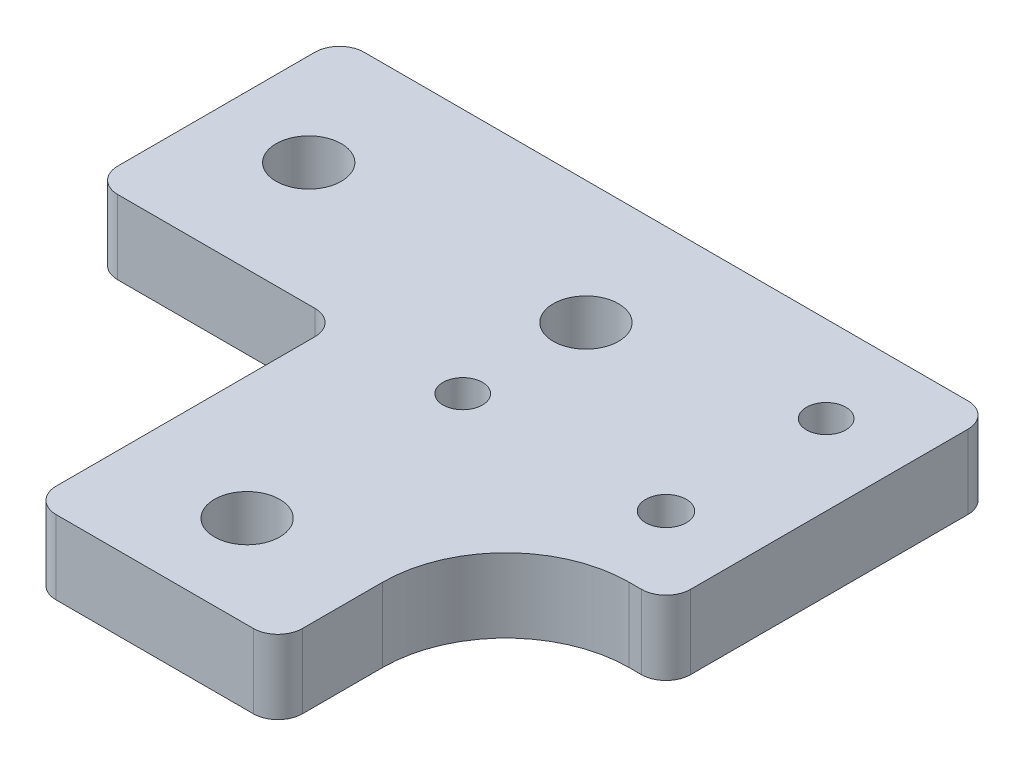
ISO-10303-21;
HEADER;
FILE_DESCRIPTION(('STEP AP214'),'2;1');
FILE_NAME('part.step','',(''),(''),'','','');
FILE_SCHEMA(('AUTOMOTIVE_DESIGN { 1 0 10303 214 1 1 1 1 }'));
ENDSEC;
DATA;
#1=APPLICATION_CONTEXT('core data for automotive mechanical design processes');
#2=APPLICATION_PROTOCOL_DEFINITION('international standard','automotive_design',2000,#1);
#3=PRODUCT_CONTEXT('',#1,'mechanical');
#4=PRODUCT('Part','Part','',(#3));
#5=PRODUCT_RELATED_PRODUCT_CATEGORY('part','',(#4));
#6=PRODUCT_DEFINITION_FORMATION('','',#4);
#7=PRODUCT_DEFINITION_CONTEXT('part definition',#1,'design');
#8=PRODUCT_DEFINITION('design','',#6,#7);
#9=PRODUCT_DEFINITION_SHAPE('','',#8);
#10=(LENGTH_UNIT() NAMED_UNIT(*) SI_UNIT(.MILLI.,.METRE.));
#11=(NAMED_UNIT(*) PLANE_ANGLE_UNIT() SI_UNIT($,.RADIAN.));
#12=(NAMED_UNIT(*) SI_UNIT($,.STERADIAN.) SOLID_ANGLE_UNIT());
#13=UNCERTAINTY_MEASURE_WITH_UNIT(LENGTH_MEASURE(1.E-05),#10,'distance_accuracy_value','');
#14=(GEOMETRIC_REPRESENTATION_CONTEXT(3) GLOBAL_UNCERTAINTY_ASSIGNED_CONTEXT((#13)) GLOBAL_UNIT_ASSIGNED_CONTEXT((#10,
#11,#12)) REPRESENTATION_CONTEXT('',''));
#15=CARTESIAN_POINT('',(0.,0.,0.));
#16=DIRECTION('',(0.,0.,1.));
#17=DIRECTION('',(1.,0.,0.));
#18=AXIS2_PLACEMENT_3D('',#15,#16,#17);
#19=CARTESIAN_POINT('',(104.,0.,2.));
#20=DIRECTION('',(0.,1.,0.));
#21=DIRECTION('',(0.,0.,1.));
#22=AXIS2_PLACEMENT_3D('',#19,#20,#21);
#23=CYLINDRICAL_SURFACE('',#22,2.);
#24=CARTESIAN_POINT('',(104.,6.,2.));
#25=DIRECTION('',(0.,1.,0.));
#26=DIRECTION('',(0.,0.,1.));
#27=AXIS2_PLACEMENT_3D('',#24,#25,#26);
#28=CIRCLE('',#27,2.);
#29=CARTESIAN_POINT('',(106.,6.,2.));
#30=VERTEX_POINT('',#29);
#31=CARTESIAN_POINT('',(104.,6.,0.));
#32=VERTEX_POINT('',#31);
#33=EDGE_CURVE('E184',#30,#32,#28,.T.);
#34=ORIENTED_EDGE('',*,*,#33,.F.);
#35=DIRECTION('',(0.,1.,0.));
#36=VECTOR('',#35,1.);
#37=CARTESIAN_POINT('',(106.,0.,2.));
#38=LINE('',#37,#36);
#39=CARTESIAN_POINT('',(106.,0.,2.));
#40=VERTEX_POINT('',#39);
#41=EDGE_CURVE('E11',#40,#30,#38,.T.);
#42=ORIENTED_EDGE('',*,*,#41,.F.);
#43=CARTESIAN_POINT('',(104.,0.,2.));
#44=DIRECTION('',(0.,1.,0.));
#45=DIRECTION('',(0.,0.,1.));
#46=AXIS2_PLACEMENT_3D('',#43,#44,#45);
#47=CIRCLE('',#46,2.);
#48=CARTESIAN_POINT('',(104.,0.,0.));
#49=VERTEX_POINT('',#48);
#50=EDGE_CURVE('E229',#40,#49,#47,.T.);
#51=ORIENTED_EDGE('',*,*,#50,.T.);
#52=DIRECTION('',(0.,1.,0.));
#53=VECTOR('',#52,1.);
#54=CARTESIAN_POINT('',(104.,0.,0.));
#55=LINE('',#54,#53);
#56=EDGE_CURVE('E42',#49,#32,#55,.T.);
#57=ORIENTED_EDGE('',*,*,#56,.T.);
#58=EDGE_LOOP('',(#34,#42,#51,#57));
#59=FACE_BOUND('',#58,.T.);
#60=ADVANCED_FACE('F39',(#59),#23,.T.);
#61=CARTESIAN_POINT('',(106.,0.,24.5));
#62=DIRECTION('',(1.,0.,0.));
#63=DIRECTION('',(0.,0.,-1.));
#64=AXIS2_PLACEMENT_3D('',#61,#62,#63);
#65=PLANE('',#64);
#66=DIRECTION('',(0.,0.,-1.));
#67=VECTOR('',#66,1.);
#68=CARTESIAN_POINT('',(106.,6.,24.5));
#69=LINE('',#68,#67);
#70=CARTESIAN_POINT('',(106.,6.,24.5));
#71=VERTEX_POINT('',#70);
#72=EDGE_CURVE('E227',#71,#30,#69,.T.);
#73=ORIENTED_EDGE('',*,*,#72,.F.);
#74=DIRECTION('',(0.,1.,0.));
#75=VECTOR('',#74,1.);
#76=CARTESIAN_POINT('',(106.,0.,24.5));
#77=LINE('',#76,#75);
#78=CARTESIAN_POINT('',(106.,0.,24.5));
#79=VERTEX_POINT('',#78);
#80=EDGE_CURVE('E48',#79,#71,#77,.T.);
#81=ORIENTED_EDGE('',*,*,#80,.F.);
#82=DIRECTION('',(0.,0.,-1.));
#83=VECTOR('',#82,1.);
#84=CARTESIAN_POINT('',(106.,0.,24.5));
#85=LINE('',#84,#83);
#86=EDGE_CURVE('E174',#79,#40,#85,.T.);
#87=ORIENTED_EDGE('',*,*,#86,.T.);
#88=ORIENTED_EDGE('',*,*,#41,.T.);
#89=EDGE_LOOP('',(#73,#81,#87,#88));
#90=FACE_BOUND('',#89,.T.);
#91=ADVANCED_FACE('F257',(#90),#65,.T.);
#92=CARTESIAN_POINT('',(104.,0.,24.5));
#93=DIRECTION('',(0.,1.,0.));
#94=DIRECTION('',(0.,0.,1.));
#95=AXIS2_PLACEMENT_3D('',#92,#93,#94);
#96=CYLINDRICAL_SURFACE('',#95,2.);
#97=CARTESIAN_POINT('',(104.,6.,24.5));
#98=DIRECTION('',(0.,1.,0.));
#99=DIRECTION('',(0.,0.,1.));
#100=AXIS2_PLACEMENT_3D('',#97,#98,#99);
#101=CIRCLE('',#100,2.);
#102=CARTESIAN_POINT('',(104.,6.,26.5));
#103=VERTEX_POINT('',#102);
#104=EDGE_CURVE('E161',#103,#71,#101,.T.);
#105=ORIENTED_EDGE('',*,*,#104,.F.);
#106=DIRECTION('',(0.,1.,0.));
#107=VECTOR('',#106,1.);
#108=CARTESIAN_POINT('',(104.,0.,26.5));
#109=LINE('',#108,#107);
#110=CARTESIAN_POINT('',(104.,0.,26.5));
#111=VERTEX_POINT('',#110);
#112=EDGE_CURVE('E156',#111,#103,#109,.T.);
#113=ORIENTED_EDGE('',*,*,#112,.F.);
#114=CARTESIAN_POINT('',(104.,0.,24.5));
#115=DIRECTION('',(0.,1.,0.));
#116=DIRECTION('',(0.,0.,1.));
#117=AXIS2_PLACEMENT_3D('',#114,#115,#116);
#118=CIRCLE('',#117,2.);
#119=EDGE_CURVE('E159',#111,#79,#118,.T.);
#120=ORIENTED_EDGE('',*,*,#119,.T.);
#121=ORIENTED_EDGE('',*,*,#80,.T.);
#122=EDGE_LOOP('',(#105,#113,#120,#121));
#123=FACE_BOUND('',#122,.T.);
#124=ADVANCED_FACE('F158',(#123),#96,.T.);
#125=CARTESIAN_POINT('',(103.,0.,26.5));
#126=DIRECTION('',(0.,0.,1.));
#127=DIRECTION('',(1.,0.,0.));
#128=AXIS2_PLACEMENT_3D('',#125,#126,#127);
#129=PLANE('',#128);
#130=DIRECTION('',(1.,0.,0.));
#131=VECTOR('',#130,1.);
#132=CARTESIAN_POINT('',(103.,6.,26.5));
#133=LINE('',#132,#131);
#134=CARTESIAN_POINT('',(103.,6.,26.5));
#135=VERTEX_POINT('',#134);
#136=EDGE_CURVE('E224',#135,#103,#133,.T.);
#137=ORIENTED_EDGE('',*,*,#136,.F.);
#138=DIRECTION('',(0.,1.,0.));
#139=VECTOR('',#138,1.);
#140=CARTESIAN_POINT('',(103.,0.,26.5));
#141=LINE('',#140,#139);
#142=CARTESIAN_POINT('',(103.,0.,26.5));
#143=VERTEX_POINT('',#142);
#144=EDGE_CURVE('E166',#143,#135,#141,.T.);
#145=ORIENTED_EDGE('',*,*,#144,.F.);
#146=DIRECTION('',(1.,0.,0.));
#147=VECTOR('',#146,1.);
#148=CARTESIAN_POINT('',(103.,0.,26.5));
#149=LINE('',#148,#147);
#150=EDGE_CURVE('E172',#143,#111,#149,.T.);
#151=ORIENTED_EDGE('',*,*,#150,.T.);
#152=ORIENTED_EDGE('',*,*,#112,.T.);
#153=EDGE_LOOP('',(#137,#145,#151,#152));
#154=FACE_BOUND('',#153,.T.);
#155=ADVANCED_FACE('F176',(#154),#129,.T.);
#156=CARTESIAN_POINT('',(103.,0.,36.5));
#157=DIRECTION('',(0.,1.,0.));
#158=DIRECTION('',(0.,0.,1.));
#159=AXIS2_PLACEMENT_3D('',#156,#157,#158);
#160=CYLINDRICAL_SURFACE('',#159,10.);
#161=CARTESIAN_POINT('',(103.,6.,36.5));
#162=DIRECTION('',(0.,-1.,0.));
#163=DIRECTION('',(0.,0.,-1.));
#164=AXIS2_PLACEMENT_3D('',#161,#162,#163);
#165=CIRCLE('',#164,10.);
#166=CARTESIAN_POINT('',(93.,6.,36.5));
#167=VERTEX_POINT('',#166);
#168=EDGE_CURVE('E221',#167,#135,#165,.T.);
#169=ORIENTED_EDGE('',*,*,#168,.F.);
#170=DIRECTION('',(0.,1.,0.));
#171=VECTOR('',#170,1.);
#172=CARTESIAN_POINT('',(93.,0.,36.5));
#173=LINE('',#172,#171);
#174=CARTESIAN_POINT('',(93.,0.,36.5));
#175=VERTEX_POINT('',#174);
#176=EDGE_CURVE('E233',#175,#167,#173,.T.);
#177=ORIENTED_EDGE('',*,*,#176,.F.);
#178=CARTESIAN_POINT('',(103.,0.,36.5));
#179=DIRECTION('',(0.,-1.,0.));
#180=DIRECTION('',(0.,0.,-1.));
#181=AXIS2_PLACEMENT_3D('',#178,#179,#180);
#182=CIRCLE('',#181,10.);
#183=EDGE_CURVE('E177',#175,#143,#182,.T.);
#184=ORIENTED_EDGE('',*,*,#183,.T.);
#185=ORIENTED_EDGE('',*,*,#144,.T.);
#186=EDGE_LOOP('',(#169,#177,#184,#185));
#187=FACE_BOUND('',#186,.T.);
#188=ADVANCED_FACE('F270',(#187),#160,.F.);
#189=CARTESIAN_POINT('',(93.,0.,43.));
#190=DIRECTION('',(1.,0.,0.));
#191=DIRECTION('',(0.,0.,-1.));
#192=AXIS2_PLACEMENT_3D('',#189,#190,#191);
#193=PLANE('',#192);
#194=DIRECTION('',(0.,0.,-1.));
#195=VECTOR('',#194,1.);
#196=CARTESIAN_POINT('',(93.,6.,43.));
#197=LINE('',#196,#195);
#198=CARTESIAN_POINT('',(93.,6.,43.));
#199=VERTEX_POINT('',#198);
#200=EDGE_CURVE('E218',#199,#167,#197,.T.);
#201=ORIENTED_EDGE('',*,*,#200,.F.);
#202=DIRECTION('',(0.,1.,0.));
#203=VECTOR('',#202,1.);
#204=CARTESIAN_POINT('',(93.,0.,43.));
#205=LINE('',#204,#203);
#206=CARTESIAN_POINT('',(93.,0.,43.));
#207=VERTEX_POINT('',#206);
#208=EDGE_CURVE('E235',#207,#199,#205,.T.);
#209=ORIENTED_EDGE('',*,*,#208,.F.);
#210=DIRECTION('',(0.,0.,-1.));
#211=VECTOR('',#210,1.);
#212=CARTESIAN_POINT('',(93.,0.,43.));
#213=LINE('',#212,#211);
#214=EDGE_CURVE('E179',#207,#175,#213,.T.);
#215=ORIENTED_EDGE('',*,*,#214,.T.);
#216=ORIENTED_EDGE('',*,*,#176,.T.);
#217=EDGE_LOOP('',(#201,#209,#215,#216));
#218=FACE_BOUND('',#217,.T.);
#219=ADVANCED_FACE('F273',(#218),#193,.T.);
#220=CARTESIAN_POINT('',(91.,0.,43.));
#221=DIRECTION('',(0.,1.,0.));
#222=DIRECTION('',(0.,0.,1.));
#223=AXIS2_PLACEMENT_3D('',#220,#221,#222);
#224=CYLINDRICAL_SURFACE('',#223,2.);
#225=CARTESIAN_POINT('',(91.,6.,43.));
#226=DIRECTION('',(0.,1.,0.));
#227=DIRECTION('',(0.,0.,1.));
#228=AXIS2_PLACEMENT_3D('',#225,#226,#227);
#229=CIRCLE('',#228,2.);
#230=CARTESIAN_POINT('',(91.,6.,45.));
#231=VERTEX_POINT('',#230);
#232=EDGE_CURVE('E215',#231,#199,#229,.T.);
#233=ORIENTED_EDGE('',*,*,#232,.F.);
#234=DIRECTION('',(0.,1.,0.));
#235=VECTOR('',#234,1.);
#236=CARTESIAN_POINT('',(91.,0.,45.));
#237=LINE('',#236,#235);
#238=CARTESIAN_POINT('',(91.,0.,45.));
#239=VERTEX_POINT('',#238);
#240=EDGE_CURVE('E237',#239,#231,#237,.T.);
#241=ORIENTED_EDGE('',*,*,#240,.F.);
#242=CARTESIAN_POINT('',(91.,0.,43.));
#243=DIRECTION('',(0.,1.,0.));
#244=DIRECTION('',(0.,0.,1.));
#245=AXIS2_PLACEMENT_3D('',#242,#243,#244);
#246=CIRCLE('',#245,2.);
#247=EDGE_CURVE('E415',#239,#207,#246,.T.);
#248=ORIENTED_EDGE('',*,*,#247,.T.);
#249=ORIENTED_EDGE('',*,*,#208,.T.);
#250=EDGE_LOOP('',(#233,#241,#248,#249));
#251=FACE_BOUND('',#250,.T.);
#252=ADVANCED_FACE('F277',(#251),#224,.T.);
#253=CARTESIAN_POINT('',(75.,0.,45.));
#254=DIRECTION('',(0.,0.,1.));
#255=DIRECTION('',(1.,0.,0.));
#256=AXIS2_PLACEMENT_3D('',#253,#254,#255);
#257=PLANE('',#256);
#258=DIRECTION('',(1.,0.,0.));
#259=VECTOR('',#258,1.);
#260=CARTESIAN_POINT('',(75.,6.,45.));
#261=LINE('',#260,#259);
#262=CARTESIAN_POINT('',(75.,6.,45.));
#263=VERTEX_POINT('',#262);
#264=EDGE_CURVE('E212',#263,#231,#261,.T.);
#265=ORIENTED_EDGE('',*,*,#264,.F.);
#266=DIRECTION('',(0.,1.,0.));
#267=VECTOR('',#266,1.);
#268=CARTESIAN_POINT('',(75.,0.,45.));
#269=LINE('',#268,#267);
#270=CARTESIAN_POINT('',(75.,0.,45.));
#271=VERTEX_POINT('',#270);
#272=EDGE_CURVE('E239',#271,#263,#269,.T.);
#273=ORIENTED_EDGE('',*,*,#272,.F.);
#274=DIRECTION('',(1.,0.,0.));
#275=VECTOR('',#274,1.);
#276=CARTESIAN_POINT('',(75.,0.,45.));
#277=LINE('',#276,#275);
#278=EDGE_CURVE('E412',#271,#239,#277,.T.);
#279=ORIENTED_EDGE('',*,*,#278,.T.);
#280=ORIENTED_EDGE('',*,*,#240,.T.);
#281=EDGE_LOOP('',(#265,#273,#279,#280));
#282=FACE_BOUND('',#281,.T.);
#283=ADVANCED_FACE('F281',(#282),#257,.T.);
#284=CARTESIAN_POINT('',(75.,0.,43.));
#285=DIRECTION('',(0.,1.,0.));
#286=DIRECTION('',(0.,0.,1.));
#287=AXIS2_PLACEMENT_3D('',#284,#285,#286);
#288=CYLINDRICAL_SURFACE('',#287,2.);
#289=CARTESIAN_POINT('',(75.,6.,43.));
#290=DIRECTION('',(0.,1.,0.));
#291=DIRECTION('',(0.,0.,1.));
#292=AXIS2_PLACEMENT_3D('',#289,#290,#291);
#293=CIRCLE('',#292,2.);
#294=CARTESIAN_POINT('',(73.,6.,43.));
#295=VERTEX_POINT('',#294);
#296=EDGE_CURVE('E209',#295,#263,#293,.T.);
#297=ORIENTED_EDGE('',*,*,#296,.F.);
#298=DIRECTION('',(0.,1.,0.));
#299=VECTOR('',#298,1.);
#300=CARTESIAN_POINT('',(73.,0.,43.));
#301=LINE('',#300,#299);
#302=CARTESIAN_POINT('',(73.,0.,43.));
#303=VERTEX_POINT('',#302);
#304=EDGE_CURVE('E241',#303,#295,#301,.T.);
#305=ORIENTED_EDGE('',*,*,#304,.F.);
#306=CARTESIAN_POINT('',(75.,0.,43.));
#307=DIRECTION('',(0.,1.,0.));
#308=DIRECTION('',(0.,0.,1.));
#309=AXIS2_PLACEMENT_3D('',#306,#307,#308);
#310=CIRCLE('',#309,2.);
#311=EDGE_CURVE('E409',#303,#271,#310,.T.);
#312=ORIENTED_EDGE('',*,*,#311,.T.);
#313=ORIENTED_EDGE('',*,*,#272,.T.);
#314=EDGE_LOOP('',(#297,#305,#312,#313));
#315=FACE_BOUND('',#314,.T.);
#316=ADVANCED_FACE('F285',(#315),#288,.T.);
#317=CARTESIAN_POINT('',(73.,0.,22.));
#318=DIRECTION('',(-1.,0.,0.));
#319=DIRECTION('',(0.,0.,1.));
#320=AXIS2_PLACEMENT_3D('',#317,#318,#319);
#321=PLANE('',#320);
#322=DIRECTION('',(0.,0.,1.));
#323=VECTOR('',#322,1.);
#324=CARTESIAN_POINT('',(73.,6.,22.));
#325=LINE('',#324,#323);
#326=CARTESIAN_POINT('',(73.,6.,22.));
#327=VERTEX_POINT('',#326);
#328=EDGE_CURVE('E206',#327,#295,#325,.T.);
#329=ORIENTED_EDGE('',*,*,#328,.F.);
#330=DIRECTION('',(0.,1.,0.));
#331=VECTOR('',#330,1.);
#332=CARTESIAN_POINT('',(73.,0.,22.));
#333=LINE('',#332,#331);
#334=CARTESIAN_POINT('',(73.,0.,22.));
#335=VERTEX_POINT('',#334);
#336=EDGE_CURVE('E243',#335,#327,#333,.T.);
#337=ORIENTED_EDGE('',*,*,#336,.F.);
#338=DIRECTION('',(0.,0.,1.));
#339=VECTOR('',#338,1.);
#340=CARTESIAN_POINT('',(73.,0.,22.));
#341=LINE('',#340,#339);
#342=EDGE_CURVE('E406',#335,#303,#341,.T.);
#343=ORIENTED_EDGE('',*,*,#342,.T.);
#344=ORIENTED_EDGE('',*,*,#304,.T.);
#345=EDGE_LOOP('',(#329,#337,#343,#344));
#346=FACE_BOUND('',#345,.T.);
#347=ADVANCED_FACE('F289',(#346),#321,.T.);
#348=CARTESIAN_POINT('',(71.,0.,22.));
#349=DIRECTION('',(0.,1.,0.));
#350=DIRECTION('',(0.,0.,1.));
#351=AXIS2_PLACEMENT_3D('',#348,#349,#350);
#352=CYLINDRICAL_SURFACE('',#351,2.);
#353=CARTESIAN_POINT('',(71.,6.,22.));
#354=DIRECTION('',(0.,-1.,0.));
#355=DIRECTION('',(0.,0.,-1.));
#356=AXIS2_PLACEMENT_3D('',#353,#354,#355);
#357=CIRCLE('',#356,2.);
#358=CARTESIAN_POINT('',(71.,6.,20.));
#359=VERTEX_POINT('',#358);
#360=EDGE_CURVE('E203',#359,#327,#357,.T.);
#361=ORIENTED_EDGE('',*,*,#360,.F.);
#362=DIRECTION('',(0.,1.,0.));
#363=VECTOR('',#362,1.);
#364=CARTESIAN_POINT('',(71.,0.,20.));
#365=LINE('',#364,#363);
#366=CARTESIAN_POINT('',(71.,0.,20.));
#367=VERTEX_POINT('',#366);
#368=EDGE_CURVE('E245',#367,#359,#365,.T.);
#369=ORIENTED_EDGE('',*,*,#368,.F.);
#370=CARTESIAN_POINT('',(71.,0.,22.));
#371=DIRECTION('',(0.,-1.,0.));
#372=DIRECTION('',(0.,0.,-1.));
#373=AXIS2_PLACEMENT_3D('',#370,#371,#372);
#374=CIRCLE('',#373,2.);
#375=EDGE_CURVE('E403',#367,#335,#374,.T.);
#376=ORIENTED_EDGE('',*,*,#375,.T.);
#377=ORIENTED_EDGE('',*,*,#336,.T.);
#378=EDGE_LOOP('',(#361,#369,#376,#377));
#379=FACE_BOUND('',#378,.T.);
#380=ADVANCED_FACE('F293',(#379),#352,.F.);
#381=CARTESIAN_POINT('',(55.,0.,20.));
#382=DIRECTION('',(0.,0.,1.));
#383=DIRECTION('',(1.,0.,0.));
#384=AXIS2_PLACEMENT_3D('',#381,#382,#383);
#385=PLANE('',#384);
#386=DIRECTION('',(1.,0.,0.));
#387=VECTOR('',#386,1.);
#388=CARTESIAN_POINT('',(55.,6.,20.));
#389=LINE('',#388,#387);
#390=CARTESIAN_POINT('',(55.,6.,20.));
#391=VERTEX_POINT('',#390);
#392=EDGE_CURVE('E200',#391,#359,#389,.T.);
#393=ORIENTED_EDGE('',*,*,#392,.F.);
#394=DIRECTION('',(0.,1.,0.));
#395=VECTOR('',#394,1.);
#396=CARTESIAN_POINT('',(55.,0.,20.));
#397=LINE('',#396,#395);
#398=CARTESIAN_POINT('',(55.,0.,20.));
#399=VERTEX_POINT('',#398);
#400=EDGE_CURVE('E247',#399,#391,#397,.T.);
#401=ORIENTED_EDGE('',*,*,#400,.F.);
#402=DIRECTION('',(1.,0.,0.));
#403=VECTOR('',#402,1.);
#404=CARTESIAN_POINT('',(55.,0.,20.));
#405=LINE('',#404,#403);
#406=EDGE_CURVE('E400',#399,#367,#405,.T.);
#407=ORIENTED_EDGE('',*,*,#406,.T.);
#408=ORIENTED_EDGE('',*,*,#368,.T.);
#409=EDGE_LOOP('',(#393,#401,#407,#408));
#410=FACE_BOUND('',#409,.T.);
#411=ADVANCED_FACE('F297',(#410),#385,.T.);
#412=CARTESIAN_POINT('',(55.,0.,18.));
#413=DIRECTION('',(0.,1.,0.));
#414=DIRECTION('',(0.,0.,1.));
#415=AXIS2_PLACEMENT_3D('',#412,#413,#414);
#416=CYLINDRICAL_SURFACE('',#415,2.);
#417=CARTESIAN_POINT('',(55.,6.,18.));
#418=DIRECTION('',(0.,1.,0.));
#419=DIRECTION('',(0.,0.,1.));
#420=AXIS2_PLACEMENT_3D('',#417,#418,#419);
#421=CIRCLE('',#420,2.);
#422=CARTESIAN_POINT('',(53.,6.,18.));
#423=VERTEX_POINT('',#422);
#424=EDGE_CURVE('E197',#423,#391,#421,.T.);
#425=ORIENTED_EDGE('',*,*,#424,.F.);
#426=DIRECTION('',(0.,1.,0.));
#427=VECTOR('',#426,1.);
#428=CARTESIAN_POINT('',(53.,0.,18.));
#429=LINE('',#428,#427);
#430=CARTESIAN_POINT('',(53.,0.,18.));
#431=VERTEX_POINT('',#430);
#432=EDGE_CURVE('E249',#431,#423,#429,.T.);
#433=ORIENTED_EDGE('',*,*,#432,.F.);
#434=CARTESIAN_POINT('',(55.,0.,18.));
#435=DIRECTION('',(0.,1.,0.));
#436=DIRECTION('',(0.,0.,1.));
#437=AXIS2_PLACEMENT_3D('',#434,#435,#436);
#438=CIRCLE('',#437,2.);
#439=EDGE_CURVE('E397',#431,#399,#438,.T.);
#440=ORIENTED_EDGE('',*,*,#439,.T.);
#441=ORIENTED_EDGE('',*,*,#400,.T.);
#442=EDGE_LOOP('',(#425,#433,#440,#441));
#443=FACE_BOUND('',#442,.T.);
#444=ADVANCED_FACE('F301',(#443),#416,.T.);
#445=CARTESIAN_POINT('',(53.,0.,2.));
#446=DIRECTION('',(-1.,0.,0.));
#447=DIRECTION('',(0.,0.,1.));
#448=AXIS2_PLACEMENT_3D('',#445,#446,#447);
#449=PLANE('',#448);
#450=DIRECTION('',(0.,0.,1.));
#451=VECTOR('',#450,1.);
#452=CARTESIAN_POINT('',(53.,6.,2.));
#453=LINE('',#452,#451);
#454=CARTESIAN_POINT('',(53.,6.,2.));
#455=VERTEX_POINT('',#454);
#456=EDGE_CURVE('E194',#455,#423,#453,.T.);
#457=ORIENTED_EDGE('',*,*,#456,.F.);
#458=DIRECTION('',(0.,1.,0.));
#459=VECTOR('',#458,1.);
#460=CARTESIAN_POINT('',(53.,0.,2.));
#461=LINE('',#460,#459);
#462=CARTESIAN_POINT('',(53.,0.,2.));
#463=VERTEX_POINT('',#462);
#464=EDGE_CURVE('E251',#463,#455,#461,.T.);
#465=ORIENTED_EDGE('',*,*,#464,.F.);
#466=DIRECTION('',(0.,0.,1.));
#467=VECTOR('',#466,1.);
#468=CARTESIAN_POINT('',(53.,0.,2.));
#469=LINE('',#468,#467);
#470=EDGE_CURVE('E394',#463,#431,#469,.T.);
#471=ORIENTED_EDGE('',*,*,#470,.T.);
#472=ORIENTED_EDGE('',*,*,#432,.T.);
#473=EDGE_LOOP('',(#457,#465,#471,#472));
#474=FACE_BOUND('',#473,.T.);
#475=ADVANCED_FACE('F305',(#474),#449,.T.);
#476=CARTESIAN_POINT('',(55.,0.,2.));
#477=DIRECTION('',(0.,1.,0.));
#478=DIRECTION('',(0.,0.,1.));
#479=AXIS2_PLACEMENT_3D('',#476,#477,#478);
#480=CYLINDRICAL_SURFACE('',#479,2.);
#481=CARTESIAN_POINT('',(55.,6.,2.));
#482=DIRECTION('',(0.,1.,0.));
#483=DIRECTION('',(0.,0.,1.));
#484=AXIS2_PLACEMENT_3D('',#481,#482,#483);
#485=CIRCLE('',#484,2.);
#486=CARTESIAN_POINT('',(55.,6.,0.));
#487=VERTEX_POINT('',#486);
#488=EDGE_CURVE('E191',#487,#455,#485,.T.);
#489=ORIENTED_EDGE('',*,*,#488,.F.);
#490=DIRECTION('',(0.,1.,0.));
#491=VECTOR('',#490,1.);
#492=CARTESIAN_POINT('',(55.,0.,0.));
#493=LINE('',#492,#491);
#494=CARTESIAN_POINT('',(55.,0.,0.));
#495=VERTEX_POINT('',#494);
#496=EDGE_CURVE('E252',#495,#487,#493,.T.);
#497=ORIENTED_EDGE('',*,*,#496,.F.);
#498=CARTESIAN_POINT('',(55.,0.,2.));
#499=DIRECTION('',(0.,1.,0.));
#500=DIRECTION('',(0.,0.,1.));
#501=AXIS2_PLACEMENT_3D('',#498,#499,#500);
#502=CIRCLE('',#501,2.);
#503=EDGE_CURVE('E391',#495,#463,#502,.T.);
#504=ORIENTED_EDGE('',*,*,#503,.T.);
#505=ORIENTED_EDGE('',*,*,#464,.T.);
#506=EDGE_LOOP('',(#489,#497,#504,#505));
#507=FACE_BOUND('',#506,.T.);
#508=ADVANCED_FACE('F309',(#507),#480,.T.);
#509=CARTESIAN_POINT('',(104.,0.,0.));
#510=DIRECTION('',(0.,0.,-1.));
#511=DIRECTION('',(-1.,0.,0.));
#512=AXIS2_PLACEMENT_3D('',#509,#510,#511);
#513=PLANE('',#512);
#514=DIRECTION('',(-1.,0.,0.));
#515=VECTOR('',#514,1.);
#516=CARTESIAN_POINT('',(104.,6.,0.));
#517=LINE('',#516,#515);
#518=EDGE_CURVE('E187',#32,#487,#517,.T.);
#519=ORIENTED_EDGE('',*,*,#518,.F.);
#520=ORIENTED_EDGE('',*,*,#56,.F.);
#521=DIRECTION('',(-1.,0.,0.));
#522=VECTOR('',#521,1.);
#523=CARTESIAN_POINT('',(104.,0.,0.));
#524=LINE('',#523,#522);
#525=EDGE_CURVE('E389',#49,#495,#524,.T.);
#526=ORIENTED_EDGE('',*,*,#525,.T.);
#527=ORIENTED_EDGE('',*,*,#496,.T.);
#528=EDGE_LOOP('',(#519,#520,#526,#527));
#529=FACE_BOUND('',#528,.T.);
#530=ADVANCED_FACE('F254',(#529),#513,.T.);
#531=CARTESIAN_POINT('',(104.,0.,2.));
#532=DIRECTION('',(0.,1.,0.));
#533=DIRECTION('',(0.,0.,1.));
#534=AXIS2_PLACEMENT_3D('',#531,#532,#533);
#535=PLANE('',#534);
#536=CARTESIAN_POINT('',(83.,0.,37.5));
#537=DIRECTION('',(0.,1.,0.));
#538=DIRECTION('',(0.,0.,-1.));
#539=AXIS2_PLACEMENT_3D('',#536,#537,#538);
#540=CIRCLE('',#539,2.65);
#541=CARTESIAN_POINT('',(83.,0.,34.85));
#542=VERTEX_POINT('',#541);
#543=EDGE_CURVE('E352',#542,#542,#540,.T.);
#544=ORIENTED_EDGE('',*,*,#543,.T.);
#545=EDGE_LOOP('',(#544));
#546=FACE_BOUND('',#545,.T.);
#547=CARTESIAN_POINT('',(60.5,0.,10.));
#548=DIRECTION('',(0.,1.,0.));
#549=DIRECTION('',(0.,0.,-1.));
#550=AXIS2_PLACEMENT_3D('',#547,#548,#549);
#551=CIRCLE('',#550,2.65);
#552=CARTESIAN_POINT('',(60.5,0.,7.35));
#553=VERTEX_POINT('',#552);
#554=EDGE_CURVE('E360',#553,#553,#551,.T.);
#555=ORIENTED_EDGE('',*,*,#554,.T.);
#556=EDGE_LOOP('',(#555));
#557=FACE_BOUND('',#556,.T.);
#558=CARTESIAN_POINT('',(83.,0.,10.));
#559=DIRECTION('',(0.,1.,0.));
#560=DIRECTION('',(0.,0.,-1.));
#561=AXIS2_PLACEMENT_3D('',#558,#559,#560);
#562=CIRCLE('',#561,2.65);
#563=CARTESIAN_POINT('',(83.,0.,7.35));
#564=VERTEX_POINT('',#563);
#565=EDGE_CURVE('E366',#564,#564,#562,.T.);
#566=ORIENTED_EDGE('',*,*,#565,.T.);
#567=EDGE_LOOP('',(#566));
#568=FACE_BOUND('',#567,.T.);
#569=CARTESIAN_POINT('',(83.,0.,20.));
#570=DIRECTION('',(0.,1.,0.));
#571=DIRECTION('',(0.,0.,-1.));
#572=AXIS2_PLACEMENT_3D('',#569,#570,#571);
#573=CIRCLE('',#572,1.6);
#574=CARTESIAN_POINT('',(83.,0.,18.4));
#575=VERTEX_POINT('',#574);
#576=EDGE_CURVE('E372',#575,#575,#573,.T.);
#577=ORIENTED_EDGE('',*,*,#576,.T.);
#578=EDGE_LOOP('',(#577));
#579=FACE_BOUND('',#578,.T.);
#580=CARTESIAN_POINT('',(99.5,0.,7.));
#581=DIRECTION('',(0.,1.,0.));
#582=DIRECTION('',(0.,0.,-1.));
#583=AXIS2_PLACEMENT_3D('',#580,#581,#582);
#584=CIRCLE('',#583,1.6);
#585=CARTESIAN_POINT('',(99.5,0.,5.4));
#586=VERTEX_POINT('',#585);
#587=EDGE_CURVE('E378',#586,#586,#584,.T.);
#588=ORIENTED_EDGE('',*,*,#587,.T.);
#589=EDGE_LOOP('',(#588));
#590=FACE_BOUND('',#589,.T.);
#591=CARTESIAN_POINT('',(99.5,0.,20.));
#592=DIRECTION('',(0.,1.,0.));
#593=DIRECTION('',(0.,0.,-1.));
#594=AXIS2_PLACEMENT_3D('',#591,#592,#593);
#595=CIRCLE('',#594,1.65);
#596=CARTESIAN_POINT('',(99.5,0.,18.35));
#597=VERTEX_POINT('',#596);
#598=EDGE_CURVE('E188',#597,#597,#595,.T.);
#599=ORIENTED_EDGE('',*,*,#598,.T.);
#600=EDGE_LOOP('',(#599));
#601=FACE_BOUND('',#600,.T.);
#602=ORIENTED_EDGE('',*,*,#50,.F.);
#603=ORIENTED_EDGE('',*,*,#86,.F.);
#604=ORIENTED_EDGE('',*,*,#119,.F.);
#605=ORIENTED_EDGE('',*,*,#150,.F.);
#606=ORIENTED_EDGE('',*,*,#183,.F.);
#607=ORIENTED_EDGE('',*,*,#214,.F.);
#608=ORIENTED_EDGE('',*,*,#247,.F.);
#609=ORIENTED_EDGE('',*,*,#278,.F.);
#610=ORIENTED_EDGE('',*,*,#311,.F.);
#611=ORIENTED_EDGE('',*,*,#342,.F.);
#612=ORIENTED_EDGE('',*,*,#375,.F.);
#613=ORIENTED_EDGE('',*,*,#406,.F.);
#614=ORIENTED_EDGE('',*,*,#439,.F.);
#615=ORIENTED_EDGE('',*,*,#470,.F.);
#616=ORIENTED_EDGE('',*,*,#503,.F.);
#617=ORIENTED_EDGE('',*,*,#525,.F.);
#618=EDGE_LOOP('',(#602,#603,#604,#605,#606,#607,#608,#609,#610,#611,#612,#613,#614,#615,#616,#617));
#619=FACE_BOUND('',#618,.T.);
#620=ADVANCED_FACE('F170',(#546,#557,#568,#579,#590,#601,#619),#535,.F.);
#621=CARTESIAN_POINT('',(104.,6.,2.));
#622=DIRECTION('',(0.,1.,0.));
#623=DIRECTION('',(0.,0.,1.));
#624=AXIS2_PLACEMENT_3D('',#621,#622,#623);
#625=PLANE('',#624);
#626=CARTESIAN_POINT('',(83.,6.,37.5));
#627=DIRECTION('',(0.,1.,0.));
#628=DIRECTION('',(0.,0.,-1.));
#629=AXIS2_PLACEMENT_3D('',#626,#627,#628);
#630=CIRCLE('',#629,2.65);
#631=CARTESIAN_POINT('',(83.,6.,34.85));
#632=VERTEX_POINT('',#631);
#633=EDGE_CURVE('E355',#632,#632,#630,.T.);
#634=ORIENTED_EDGE('',*,*,#633,.F.);
#635=EDGE_LOOP('',(#634));
#636=FACE_BOUND('',#635,.T.);
#637=CARTESIAN_POINT('',(60.5,6.,10.));
#638=DIRECTION('',(0.,1.,0.));
#639=DIRECTION('',(0.,0.,-1.));
#640=AXIS2_PLACEMENT_3D('',#637,#638,#639);
#641=CIRCLE('',#640,2.65);
#642=CARTESIAN_POINT('',(60.5,6.,7.35));
#643=VERTEX_POINT('',#642);
#644=EDGE_CURVE('E357',#643,#643,#641,.T.);
#645=ORIENTED_EDGE('',*,*,#644,.F.);
#646=EDGE_LOOP('',(#645));
#647=FACE_BOUND('',#646,.T.);
#648=CARTESIAN_POINT('',(83.,6.,10.));
#649=DIRECTION('',(0.,1.,0.));
#650=DIRECTION('',(0.,0.,-1.));
#651=AXIS2_PLACEMENT_3D('',#648,#649,#650);
#652=CIRCLE('',#651,2.65);
#653=CARTESIAN_POINT('',(83.,6.,7.35));
#654=VERTEX_POINT('',#653);
#655=EDGE_CURVE('E363',#654,#654,#652,.T.);
#656=ORIENTED_EDGE('',*,*,#655,.F.);
#657=EDGE_LOOP('',(#656));
#658=FACE_BOUND('',#657,.T.);
#659=CARTESIAN_POINT('',(83.,6.,20.));
#660=DIRECTION('',(0.,1.,0.));
#661=DIRECTION('',(0.,0.,-1.));
#662=AXIS2_PLACEMENT_3D('',#659,#660,#661);
#663=CIRCLE('',#662,1.6);
#664=CARTESIAN_POINT('',(83.,6.,18.4));
#665=VERTEX_POINT('',#664);
#666=EDGE_CURVE('E369',#665,#665,#663,.T.);
#667=ORIENTED_EDGE('',*,*,#666,.F.);
#668=EDGE_LOOP('',(#667));
#669=FACE_BOUND('',#668,.T.);
#670=CARTESIAN_POINT('',(99.5,6.,7.));
#671=DIRECTION('',(0.,1.,0.));
#672=DIRECTION('',(0.,0.,-1.));
#673=AXIS2_PLACEMENT_3D('',#670,#671,#672);
#674=CIRCLE('',#673,1.6);
#675=CARTESIAN_POINT('',(99.5,6.,5.4));
#676=VERTEX_POINT('',#675);
#677=EDGE_CURVE('E375',#676,#676,#674,.T.);
#678=ORIENTED_EDGE('',*,*,#677,.F.);
#679=EDGE_LOOP('',(#678));
#680=FACE_BOUND('',#679,.T.);
#681=CARTESIAN_POINT('',(99.5,6.,20.));
#682=DIRECTION('',(0.,1.,0.));
#683=DIRECTION('',(0.,0.,-1.));
#684=AXIS2_PLACEMENT_3D('',#681,#682,#683);
#685=CIRCLE('',#684,1.65);
#686=CARTESIAN_POINT('',(99.5,6.,18.35));
#687=VERTEX_POINT('',#686);
#688=EDGE_CURVE('E381',#687,#687,#685,.T.);
#689=ORIENTED_EDGE('',*,*,#688,.F.);
#690=EDGE_LOOP('',(#689));
#691=FACE_BOUND('',#690,.T.);
#692=ORIENTED_EDGE('',*,*,#33,.T.);
#693=ORIENTED_EDGE('',*,*,#518,.T.);
#694=ORIENTED_EDGE('',*,*,#488,.T.);
#695=ORIENTED_EDGE('',*,*,#456,.T.);
#696=ORIENTED_EDGE('',*,*,#424,.T.);
#697=ORIENTED_EDGE('',*,*,#392,.T.);
#698=ORIENTED_EDGE('',*,*,#360,.T.);
#699=ORIENTED_EDGE('',*,*,#328,.T.);
#700=ORIENTED_EDGE('',*,*,#296,.T.);
#701=ORIENTED_EDGE('',*,*,#264,.T.);
#702=ORIENTED_EDGE('',*,*,#232,.T.);
#703=ORIENTED_EDGE('',*,*,#200,.T.);
#704=ORIENTED_EDGE('',*,*,#168,.T.);
#705=ORIENTED_EDGE('',*,*,#136,.T.);
#706=ORIENTED_EDGE('',*,*,#104,.T.);
#707=ORIENTED_EDGE('',*,*,#72,.T.);
#708=EDGE_LOOP('',(#692,#693,#694,#695,#696,#697,#698,#699,#700,#701,#702,#703,#704,#705,#706,#707));
#709=FACE_BOUND('',#708,.T.);
#710=ADVANCED_FACE('F256',(#636,#647,#658,#669,#680,#691,#709),#625,.T.);
#711=CARTESIAN_POINT('',(99.5,0.,20.));
#712=DIRECTION('',(0.,1.,0.));
#713=DIRECTION('',(0.,0.,1.));
#714=AXIS2_PLACEMENT_3D('',#711,#712,#713);
#715=CYLINDRICAL_SURFACE('',#714,1.65);
#716=ORIENTED_EDGE('',*,*,#598,.F.);
#717=EDGE_LOOP('',(#716));
#718=FACE_BOUND('',#717,.T.);
#719=ORIENTED_EDGE('',*,*,#688,.T.);
#720=EDGE_LOOP('',(#719));
#721=FACE_BOUND('',#720,.T.);
#722=ADVANCED_FACE('F321',(#718,#721),#715,.F.);
#723=CARTESIAN_POINT('',(99.5,0.,7.));
#724=DIRECTION('',(0.,1.,0.));
#725=DIRECTION('',(0.,0.,1.));
#726=AXIS2_PLACEMENT_3D('',#723,#724,#725);
#727=CYLINDRICAL_SURFACE('',#726,1.6);
#728=ORIENTED_EDGE('',*,*,#587,.F.);
#729=EDGE_LOOP('',(#728));
#730=FACE_BOUND('',#729,.T.);
#731=ORIENTED_EDGE('',*,*,#677,.T.);
#732=EDGE_LOOP('',(#731));
#733=FACE_BOUND('',#732,.T.);
#734=ADVANCED_FACE('F328',(#730,#733),#727,.F.);
#735=CARTESIAN_POINT('',(83.,0.,20.));
#736=DIRECTION('',(0.,1.,0.));
#737=DIRECTION('',(0.,0.,1.));
#738=AXIS2_PLACEMENT_3D('',#735,#736,#737);
#739=CYLINDRICAL_SURFACE('',#738,1.6);
#740=ORIENTED_EDGE('',*,*,#576,.F.);
#741=EDGE_LOOP('',(#740));
#742=FACE_BOUND('',#741,.T.);
#743=ORIENTED_EDGE('',*,*,#666,.T.);
#744=EDGE_LOOP('',(#743));
#745=FACE_BOUND('',#744,.T.);
#746=ADVANCED_FACE('F332',(#742,#745),#739,.F.);
#747=CARTESIAN_POINT('',(83.,0.,10.));
#748=DIRECTION('',(0.,1.,0.));
#749=DIRECTION('',(0.,0.,1.));
#750=AXIS2_PLACEMENT_3D('',#747,#748,#749);
#751=CYLINDRICAL_SURFACE('',#750,2.65);
#752=ORIENTED_EDGE('',*,*,#565,.F.);
#753=EDGE_LOOP('',(#752));
#754=FACE_BOUND('',#753,.T.);
#755=ORIENTED_EDGE('',*,*,#655,.T.);
#756=EDGE_LOOP('',(#755));
#757=FACE_BOUND('',#756,.T.);
#758=ADVANCED_FACE('F336',(#754,#757),#751,.F.);
#759=CARTESIAN_POINT('',(60.5,0.,10.));
#760=DIRECTION('',(0.,1.,0.));
#761=DIRECTION('',(0.,0.,1.));
#762=AXIS2_PLACEMENT_3D('',#759,#760,#761);
#763=CYLINDRICAL_SURFACE('',#762,2.65);
#764=ORIENTED_EDGE('',*,*,#554,.F.);
#765=EDGE_LOOP('',(#764));
#766=FACE_BOUND('',#765,.T.);
#767=ORIENTED_EDGE('',*,*,#644,.T.);
#768=EDGE_LOOP('',(#767));
#769=FACE_BOUND('',#768,.T.);
#770=ADVANCED_FACE('F340',(#766,#769),#763,.F.);
#771=CARTESIAN_POINT('',(83.,0.,37.5));
#772=DIRECTION('',(0.,1.,0.));
#773=DIRECTION('',(0.,0.,1.));
#774=AXIS2_PLACEMENT_3D('',#771,#772,#773);
#775=CYLINDRICAL_SURFACE('',#774,2.65);
#776=ORIENTED_EDGE('',*,*,#543,.F.);
#777=EDGE_LOOP('',(#776));
#778=FACE_BOUND('',#777,.T.);
#779=ORIENTED_EDGE('',*,*,#633,.T.);
#780=EDGE_LOOP('',(#779));
#781=FACE_BOUND('',#780,.T.);
#782=ADVANCED_FACE('F344',(#778,#781),#775,.F.);
#783=CLOSED_SHELL('',(#60,#91,#124,#155,#188,#219,#252,#283,#316,#347,#380,#411,#444,#475,#508,
#530,#620,#710,#722,#734,#746,#758,#770,#782));
#784=MANIFOLD_SOLID_BREP('B2',#783);
#785=ADVANCED_BREP_SHAPE_REPRESENTATION('',(#18,#784),#14);
#786=SHAPE_DEFINITION_REPRESENTATION(#9,#785);
ENDSEC;
END-ISO-10303-21;
